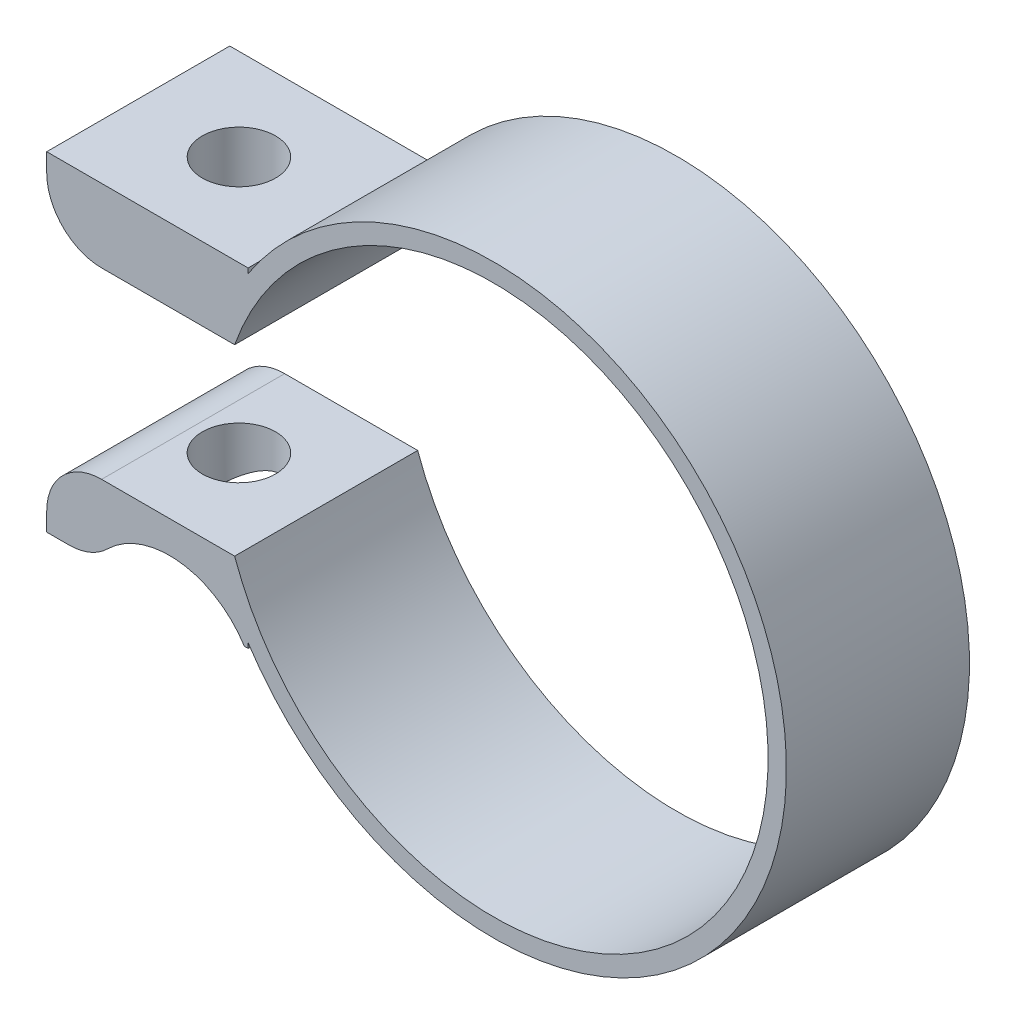
ISO-10303-21;
HEADER;
FILE_DESCRIPTION(('STEP AP214'),'2;1');
FILE_NAME('part.step','',(''),(''),'','','');
FILE_SCHEMA(('AUTOMOTIVE_DESIGN { 1 0 10303 214 1 1 1 1 }'));
ENDSEC;
DATA;
#1=APPLICATION_CONTEXT('core data for automotive mechanical design processes');
#2=APPLICATION_PROTOCOL_DEFINITION('international standard','automotive_design',2000,#1);
#3=PRODUCT_CONTEXT('',#1,'mechanical');
#4=PRODUCT('Part','Part','',(#3));
#5=PRODUCT_RELATED_PRODUCT_CATEGORY('part','',(#4));
#6=PRODUCT_DEFINITION_FORMATION('','',#4);
#7=PRODUCT_DEFINITION_CONTEXT('part definition',#1,'design');
#8=PRODUCT_DEFINITION('design','',#6,#7);
#9=PRODUCT_DEFINITION_SHAPE('','',#8);
#10=(LENGTH_UNIT() NAMED_UNIT(*) SI_UNIT(.MILLI.,.METRE.));
#11=(NAMED_UNIT(*) PLANE_ANGLE_UNIT() SI_UNIT($,.RADIAN.));
#12=(NAMED_UNIT(*) SI_UNIT($,.STERADIAN.) SOLID_ANGLE_UNIT());
#13=UNCERTAINTY_MEASURE_WITH_UNIT(LENGTH_MEASURE(1.E-05),#10,'distance_accuracy_value','');
#14=(GEOMETRIC_REPRESENTATION_CONTEXT(3) GLOBAL_UNCERTAINTY_ASSIGNED_CONTEXT((#13)) GLOBAL_UNIT_ASSIGNED_CONTEXT((#10,
#11,#12)) REPRESENTATION_CONTEXT('',''));
#15=CARTESIAN_POINT('',(0.,0.,0.));
#16=DIRECTION('',(0.,0.,1.));
#17=DIRECTION('',(1.,0.,0.));
#18=AXIS2_PLACEMENT_3D('',#15,#16,#17);
#19=CARTESIAN_POINT('',(0.,-9.00000000000001,10.));
#20=DIRECTION('',(0.,-1.,0.));
#21=DIRECTION('',(1.,0.,0.));
#22=AXIS2_PLACEMENT_3D('',#19,#20,#21);
#23=PLANE('',#22);
#24=DIRECTION('',(-1.,0.,0.));
#25=VECTOR('',#24,1.);
#26=CARTESIAN_POINT('',(0.,-9.00000000000001,0.));
#27=LINE('',#26,#25);
#28=CARTESIAN_POINT('',(-23.1984559063869,-9.00000000000001,0.));
#29=VERTEX_POINT('',#28);
#30=CARTESIAN_POINT('',(-24.407545237898,-9.00000000000001,0.));
#31=VERTEX_POINT('',#30);
#32=EDGE_CURVE('E167',#29,#31,#27,.T.);
#33=ORIENTED_EDGE('',*,*,#32,.F.);
#34=DIRECTION('',(0.,0.,1.));
#35=VECTOR('',#34,1.);
#36=CARTESIAN_POINT('',(-23.1984559063869,-9.00000000000001,10.));
#37=LINE('',#36,#35);
#38=CARTESIAN_POINT('',(-23.1984559063869,-9.00000000000001,10.));
#39=VERTEX_POINT('',#38);
#40=EDGE_CURVE('E45',#29,#39,#37,.T.);
#41=ORIENTED_EDGE('',*,*,#40,.T.);
#42=DIRECTION('',(-1.,0.,0.));
#43=VECTOR('',#42,1.);
#44=CARTESIAN_POINT('',(0.,-9.00000000000001,10.));
#45=LINE('',#44,#43);
#46=CARTESIAN_POINT('',(-24.407545237898,-9.00000000000001,10.));
#47=VERTEX_POINT('',#46);
#48=EDGE_CURVE('E312',#39,#47,#45,.T.);
#49=ORIENTED_EDGE('',*,*,#48,.T.);
#50=DIRECTION('',(0.,0.,-1.));
#51=VECTOR('',#50,1.);
#52=CARTESIAN_POINT('',(-24.407545237898,-9.00000000000001,10.));
#53=LINE('',#52,#51);
#54=EDGE_CURVE('E199',#47,#31,#53,.T.);
#55=ORIENTED_EDGE('',*,*,#54,.T.);
#56=EDGE_LOOP('',(#33,#41,#49,#55));
#57=FACE_BOUND('',#56,.T.);
#58=ADVANCED_FACE('F37',(#57),#23,.T.);
#59=CARTESIAN_POINT('',(0.,4.99999999999999,10.));
#60=DIRECTION('',(0.,-1.,0.));
#61=DIRECTION('',(0.,0.,-1.));
#62=AXIS2_PLACEMENT_3D('',#59,#60,#61);
#63=PLANE('',#62);
#64=CARTESIAN_POINT('',(-18.907545237898,4.99999999999999,5.));
#65=DIRECTION('',(0.,-1.,0.));
#66=DIRECTION('',(0.,0.,-1.));
#67=AXIS2_PLACEMENT_3D('',#64,#65,#66);
#68=CIRCLE('',#67,2.);
#69=CARTESIAN_POINT('',(-18.907545237898,4.99999999999999,3.));
#70=VERTEX_POINT('',#69);
#71=EDGE_CURVE('E306',#70,#70,#68,.T.);
#72=ORIENTED_EDGE('',*,*,#71,.F.);
#73=EDGE_LOOP('',(#72));
#74=FACE_BOUND('',#73,.T.);
#75=DIRECTION('',(-1.,0.,0.));
#76=VECTOR('',#75,1.);
#77=CARTESIAN_POINT('',(0.,4.99999999999999,10.));
#78=LINE('',#77,#76);
#79=CARTESIAN_POINT('',(-14.1421356237309,5.00000000000001,10.));
#80=VERTEX_POINT('',#79);
#81=CARTESIAN_POINT('',(-21.407545237898,4.99999999999999,10.));
#82=VERTEX_POINT('',#81);
#83=EDGE_CURVE('E185',#80,#82,#78,.T.);
#84=ORIENTED_EDGE('',*,*,#83,.T.);
#85=DIRECTION('',(0.,0.,-1.));
#86=VECTOR('',#85,1.);
#87=CARTESIAN_POINT('',(-21.407545237898,4.99999999999999,0.));
#88=LINE('',#87,#86);
#89=CARTESIAN_POINT('',(-21.407545237898,4.99999999999999,0.));
#90=VERTEX_POINT('',#89);
#91=EDGE_CURVE('E220',#82,#90,#88,.T.);
#92=ORIENTED_EDGE('',*,*,#91,.T.);
#93=DIRECTION('',(-1.,0.,0.));
#94=VECTOR('',#93,1.);
#95=CARTESIAN_POINT('',(0.,4.99999999999999,0.));
#96=LINE('',#95,#94);
#97=CARTESIAN_POINT('',(-14.1421356237309,5.00000000000001,0.));
#98=VERTEX_POINT('',#97);
#99=EDGE_CURVE('E324',#98,#90,#96,.T.);
#100=ORIENTED_EDGE('',*,*,#99,.F.);
#101=DIRECTION('',(0.,0.,-1.));
#102=VECTOR('',#101,1.);
#103=CARTESIAN_POINT('',(-14.1421356237309,5.00000000000001,10.));
#104=LINE('',#103,#102);
#105=EDGE_CURVE('E205',#80,#98,#104,.T.);
#106=ORIENTED_EDGE('',*,*,#105,.F.);
#107=EDGE_LOOP('',(#84,#92,#100,#106));
#108=FACE_BOUND('',#107,.T.);
#109=ADVANCED_FACE('F246',(#74,#108),#63,.T.);
#110=CARTESIAN_POINT('',(0.,0.,10.));
#111=DIRECTION('',(0.,0.,-1.));
#112=DIRECTION('',(-1.,0.,0.));
#113=AXIS2_PLACEMENT_3D('',#110,#111,#112);
#114=CYLINDRICAL_SURFACE('',#113,15.);
#115=CARTESIAN_POINT('',(0.,0.,0.));
#116=DIRECTION('',(0.,0.,1.));
#117=DIRECTION('',(1.,0.,0.));
#118=AXIS2_PLACEMENT_3D('',#115,#116,#117);
#119=CIRCLE('',#118,15.);
#120=CARTESIAN_POINT('',(-14.1421356237309,-5.00000000000001,0.));
#121=VERTEX_POINT('',#120);
#122=EDGE_CURVE('E326',#121,#98,#119,.T.);
#123=ORIENTED_EDGE('',*,*,#122,.F.);
#124=DIRECTION('',(0.,0.,-1.));
#125=VECTOR('',#124,1.);
#126=CARTESIAN_POINT('',(-14.1421356237309,-5.00000000000001,10.));
#127=LINE('',#126,#125);
#128=CARTESIAN_POINT('',(-14.1421356237309,-5.00000000000001,10.));
#129=VERTEX_POINT('',#128);
#130=EDGE_CURVE('E202',#129,#121,#127,.T.);
#131=ORIENTED_EDGE('',*,*,#130,.F.);
#132=CARTESIAN_POINT('',(0.,0.,10.));
#133=DIRECTION('',(0.,0.,1.));
#134=DIRECTION('',(1.,0.,0.));
#135=AXIS2_PLACEMENT_3D('',#132,#133,#134);
#136=CIRCLE('',#135,15.);
#137=EDGE_CURVE('E301',#129,#80,#136,.T.);
#138=ORIENTED_EDGE('',*,*,#137,.T.);
#139=ORIENTED_EDGE('',*,*,#105,.T.);
#140=EDGE_LOOP('',(#123,#131,#138,#139));
#141=FACE_BOUND('',#140,.T.);
#142=ADVANCED_FACE('F251',(#141),#114,.F.);
#143=CARTESIAN_POINT('',(0.,-5.00000000000001,10.));
#144=DIRECTION('',(0.,1.,0.));
#145=DIRECTION('',(0.,0.,1.));
#146=AXIS2_PLACEMENT_3D('',#143,#144,#145);
#147=PLANE('',#146);
#148=CARTESIAN_POINT('',(-18.907545237898,-5.00000000000001,5.));
#149=DIRECTION('',(0.,1.,0.));
#150=DIRECTION('',(0.,0.,1.));
#151=AXIS2_PLACEMENT_3D('',#148,#149,#150);
#152=CIRCLE('',#151,2.);
#153=CARTESIAN_POINT('',(-18.907545237898,-5.00000000000001,7.));
#154=VERTEX_POINT('',#153);
#155=EDGE_CURVE('E362',#154,#154,#152,.T.);
#156=ORIENTED_EDGE('',*,*,#155,.F.);
#157=EDGE_LOOP('',(#156));
#158=FACE_BOUND('',#157,.T.);
#159=DIRECTION('',(1.,0.,0.));
#160=VECTOR('',#159,1.);
#161=CARTESIAN_POINT('',(0.,-5.00000000000001,0.));
#162=LINE('',#161,#160);
#163=CARTESIAN_POINT('',(-21.407545237898,-5.00000000000001,0.));
#164=VERTEX_POINT('',#163);
#165=EDGE_CURVE('E328',#164,#121,#162,.T.);
#166=ORIENTED_EDGE('',*,*,#165,.F.);
#167=DIRECTION('',(0.,0.,-1.));
#168=VECTOR('',#167,1.);
#169=CARTESIAN_POINT('',(-21.407545237898,-5.00000000000001,10.));
#170=LINE('',#169,#168);
#171=CARTESIAN_POINT('',(-21.407545237898,-5.00000000000001,10.));
#172=VERTEX_POINT('',#171);
#173=EDGE_CURVE('E214',#164,#172,#170,.F.);
#174=ORIENTED_EDGE('',*,*,#173,.T.);
#175=DIRECTION('',(1.,0.,0.));
#176=VECTOR('',#175,1.);
#177=CARTESIAN_POINT('',(0.,-5.00000000000001,10.));
#178=LINE('',#177,#176);
#179=EDGE_CURVE('E303',#172,#129,#178,.T.);
#180=ORIENTED_EDGE('',*,*,#179,.T.);
#181=ORIENTED_EDGE('',*,*,#130,.T.);
#182=EDGE_LOOP('',(#166,#174,#180,#181));
#183=FACE_BOUND('',#182,.T.);
#184=ADVANCED_FACE('F265',(#158,#183),#147,.T.);
#185=CARTESIAN_POINT('',(-24.407545237898,0.,10.));
#186=DIRECTION('',(-1.,0.,0.));
#187=DIRECTION('',(0.,0.,1.));
#188=AXIS2_PLACEMENT_3D('',#185,#186,#187);
#189=PLANE('',#188);
#190=DIRECTION('',(0.,1.,0.));
#191=VECTOR('',#190,1.);
#192=CARTESIAN_POINT('',(-24.407545237898,0.,10.));
#193=LINE('',#192,#191);
#194=CARTESIAN_POINT('',(-24.407545237898,-8.00000000000001,10.));
#195=VERTEX_POINT('',#194);
#196=EDGE_CURVE('E310',#47,#195,#193,.T.);
#197=ORIENTED_EDGE('',*,*,#196,.T.);
#198=DIRECTION('',(0.,0.,-1.));
#199=VECTOR('',#198,1.);
#200=CARTESIAN_POINT('',(-24.407545237898,-8.00000000000001,10.));
#201=LINE('',#200,#199);
#202=CARTESIAN_POINT('',(-24.407545237898,-8.00000000000001,0.));
#203=VERTEX_POINT('',#202);
#204=EDGE_CURVE('E207',#195,#203,#201,.T.);
#205=ORIENTED_EDGE('',*,*,#204,.T.);
#206=DIRECTION('',(0.,1.,0.));
#207=VECTOR('',#206,1.);
#208=CARTESIAN_POINT('',(-24.407545237898,0.,0.));
#209=LINE('',#208,#207);
#210=EDGE_CURVE('E171',#31,#203,#209,.T.);
#211=ORIENTED_EDGE('',*,*,#210,.F.);
#212=ORIENTED_EDGE('',*,*,#54,.F.);
#213=EDGE_LOOP('',(#197,#205,#211,#212));
#214=FACE_BOUND('',#213,.T.);
#215=ADVANCED_FACE('F258',(#214),#189,.T.);
#216=DIRECTION('',(0.,0.,-1.));
#217=VECTOR('',#216,1.);
#218=CARTESIAN_POINT('',(-13.609888338559,-9.00000000000001,21.));
#219=LINE('',#218,#217);
#220=CARTESIAN_POINT('',(-13.609888338559,-9.00000000000001,0.));
#221=VERTEX_POINT('',#220);
#222=CARTESIAN_POINT('',(-13.609888338559,-9.00000000000001,10.));
#223=VERTEX_POINT('',#222);
#224=EDGE_CURVE('E146',#221,#223,#219,.F.);
#225=ORIENTED_EDGE('',*,*,#224,.F.);
#226=CARTESIAN_POINT('',(-13.407545237898,-9.00000000000001,0.));
#227=VERTEX_POINT('',#226);
#228=EDGE_CURVE('E157',#227,#221,#27,.T.);
#229=ORIENTED_EDGE('',*,*,#228,.F.);
#230=DIRECTION('',(0.,0.,-1.));
#231=VECTOR('',#230,1.);
#232=CARTESIAN_POINT('',(-13.407545237898,-9.00000000000001,10.));
#233=LINE('',#232,#231);
#234=CARTESIAN_POINT('',(-13.407545237898,-9.00000000000001,10.));
#235=VERTEX_POINT('',#234);
#236=EDGE_CURVE('E197',#235,#227,#233,.T.);
#237=ORIENTED_EDGE('',*,*,#236,.F.);
#238=EDGE_CURVE('E159',#235,#223,#45,.T.);
#239=ORIENTED_EDGE('',*,*,#238,.T.);
#240=EDGE_LOOP('',(#225,#229,#237,#239));
#241=FACE_BOUND('',#240,.T.);
#242=ADVANCED_FACE('F156',(#241),#23,.T.);
#243=CARTESIAN_POINT('',(-13.407545237898,0.,10.));
#244=DIRECTION('',(-1.,0.,0.));
#245=DIRECTION('',(0.,0.,1.));
#246=AXIS2_PLACEMENT_3D('',#243,#244,#245);
#247=PLANE('',#246);
#248=DIRECTION('',(0.,1.,0.));
#249=VECTOR('',#248,1.);
#250=CARTESIAN_POINT('',(-13.407545237898,0.,0.));
#251=LINE('',#250,#249);
#252=CARTESIAN_POINT('',(-13.407545237898,-8.73142203158911,0.));
#253=VERTEX_POINT('',#252);
#254=EDGE_CURVE('E166',#227,#253,#251,.T.);
#255=ORIENTED_EDGE('',*,*,#254,.T.);
#256=DIRECTION('',(0.,0.,-1.));
#257=VECTOR('',#256,1.);
#258=CARTESIAN_POINT('',(-13.407545237898,-8.73142203158911,10.));
#259=LINE('',#258,#257);
#260=CARTESIAN_POINT('',(-13.407545237898,-8.73142203158911,10.));
#261=VERTEX_POINT('',#260);
#262=EDGE_CURVE('E194',#261,#253,#259,.T.);
#263=ORIENTED_EDGE('',*,*,#262,.F.);
#264=DIRECTION('',(0.,1.,0.));
#265=VECTOR('',#264,1.);
#266=CARTESIAN_POINT('',(-13.407545237898,0.,10.));
#267=LINE('',#266,#265);
#268=EDGE_CURVE('E314',#235,#261,#267,.T.);
#269=ORIENTED_EDGE('',*,*,#268,.F.);
#270=ORIENTED_EDGE('',*,*,#236,.T.);
#271=EDGE_LOOP('',(#255,#263,#269,#270));
#272=FACE_BOUND('',#271,.T.);
#273=ADVANCED_FACE('F257',(#272),#247,.F.);
#274=CARTESIAN_POINT('',(0.,0.,10.));
#275=DIRECTION('',(0.,0.,-1.));
#276=DIRECTION('',(-1.,0.,0.));
#277=AXIS2_PLACEMENT_3D('',#274,#275,#276);
#278=CYLINDRICAL_SURFACE('',#277,16.);
#279=CARTESIAN_POINT('',(0.,0.,0.));
#280=DIRECTION('',(0.,0.,1.));
#281=DIRECTION('',(1.,0.,0.));
#282=AXIS2_PLACEMENT_3D('',#279,#280,#281);
#283=CIRCLE('',#282,16.);
#284=CARTESIAN_POINT('',(-13.407545237898,8.73142203158911,0.));
#285=VERTEX_POINT('',#284);
#286=EDGE_CURVE('E169',#253,#285,#283,.T.);
#287=ORIENTED_EDGE('',*,*,#286,.T.);
#288=DIRECTION('',(0.,0.,-1.));
#289=VECTOR('',#288,1.);
#290=CARTESIAN_POINT('',(-13.407545237898,8.73142203158911,10.));
#291=LINE('',#290,#289);
#292=CARTESIAN_POINT('',(-13.407545237898,8.73142203158911,10.));
#293=VERTEX_POINT('',#292);
#294=EDGE_CURVE('E192',#293,#285,#291,.T.);
#295=ORIENTED_EDGE('',*,*,#294,.F.);
#296=CARTESIAN_POINT('',(0.,0.,10.));
#297=DIRECTION('',(0.,0.,1.));
#298=DIRECTION('',(1.,0.,0.));
#299=AXIS2_PLACEMENT_3D('',#296,#297,#298);
#300=CIRCLE('',#299,16.);
#301=EDGE_CURVE('E316',#261,#293,#300,.T.);
#302=ORIENTED_EDGE('',*,*,#301,.F.);
#303=ORIENTED_EDGE('',*,*,#262,.T.);
#304=EDGE_LOOP('',(#287,#295,#302,#303));
#305=FACE_BOUND('',#304,.T.);
#306=ADVANCED_FACE('F263',(#305),#278,.T.);
#307=CARTESIAN_POINT('',(-13.407545237898,0.,10.));
#308=DIRECTION('',(1.,0.,0.));
#309=DIRECTION('',(0.,0.,-1.));
#310=AXIS2_PLACEMENT_3D('',#307,#308,#309);
#311=PLANE('',#310);
#312=DIRECTION('',(0.,-1.,0.));
#313=VECTOR('',#312,1.);
#314=CARTESIAN_POINT('',(-13.407545237898,0.,0.));
#315=LINE('',#314,#313);
#316=CARTESIAN_POINT('',(-13.407545237898,8.99999999999999,0.));
#317=VERTEX_POINT('',#316);
#318=EDGE_CURVE('E177',#317,#285,#315,.T.);
#319=ORIENTED_EDGE('',*,*,#318,.F.);
#320=DIRECTION('',(0.,0.,-1.));
#321=VECTOR('',#320,1.);
#322=CARTESIAN_POINT('',(-13.407545237898,8.99999999999999,10.));
#323=LINE('',#322,#321);
#324=CARTESIAN_POINT('',(-13.407545237898,8.99999999999999,10.));
#325=VERTEX_POINT('',#324);
#326=EDGE_CURVE('E189',#325,#317,#323,.T.);
#327=ORIENTED_EDGE('',*,*,#326,.F.);
#328=DIRECTION('',(0.,-1.,0.));
#329=VECTOR('',#328,1.);
#330=CARTESIAN_POINT('',(-13.407545237898,0.,10.));
#331=LINE('',#330,#329);
#332=EDGE_CURVE('E318',#325,#293,#331,.T.);
#333=ORIENTED_EDGE('',*,*,#332,.T.);
#334=ORIENTED_EDGE('',*,*,#294,.T.);
#335=EDGE_LOOP('',(#319,#327,#333,#334));
#336=FACE_BOUND('',#335,.T.);
#337=ADVANCED_FACE('F352',(#336),#311,.T.);
#338=CARTESIAN_POINT('',(0.,8.99999999999999,10.));
#339=DIRECTION('',(0.,-1.,0.));
#340=DIRECTION('',(1.,0.,0.));
#341=AXIS2_PLACEMENT_3D('',#338,#339,#340);
#342=PLANE('',#341);
#343=CARTESIAN_POINT('',(-18.907545237898,8.99999999999999,5.));
#344=DIRECTION('',(0.,1.,0.));
#345=DIRECTION('',(-1.,0.,0.));
#346=AXIS2_PLACEMENT_3D('',#343,#344,#345);
#347=CIRCLE('',#346,2.);
#348=CARTESIAN_POINT('',(-20.907545237898,8.99999999999999,5.));
#349=VERTEX_POINT('',#348);
#350=EDGE_CURVE('E160',#349,#349,#347,.T.);
#351=ORIENTED_EDGE('',*,*,#350,.F.);
#352=EDGE_LOOP('',(#351));
#353=FACE_BOUND('',#352,.T.);
#354=DIRECTION('',(-1.,0.,0.));
#355=VECTOR('',#354,1.);
#356=CARTESIAN_POINT('',(0.,8.99999999999999,0.));
#357=LINE('',#356,#355);
#358=CARTESIAN_POINT('',(-24.407545237898,8.99999999999999,0.));
#359=VERTEX_POINT('',#358);
#360=EDGE_CURVE('E180',#317,#359,#357,.T.);
#361=ORIENTED_EDGE('',*,*,#360,.T.);
#362=DIRECTION('',(0.,0.,-1.));
#363=VECTOR('',#362,1.);
#364=CARTESIAN_POINT('',(-24.407545237898,8.99999999999999,10.));
#365=LINE('',#364,#363);
#366=CARTESIAN_POINT('',(-24.407545237898,8.99999999999999,10.));
#367=VERTEX_POINT('',#366);
#368=EDGE_CURVE('E186',#367,#359,#365,.T.);
#369=ORIENTED_EDGE('',*,*,#368,.F.);
#370=DIRECTION('',(-1.,0.,0.));
#371=VECTOR('',#370,1.);
#372=CARTESIAN_POINT('',(0.,8.99999999999999,10.));
#373=LINE('',#372,#371);
#374=EDGE_CURVE('E321',#325,#367,#373,.T.);
#375=ORIENTED_EDGE('',*,*,#374,.F.);
#376=ORIENTED_EDGE('',*,*,#326,.T.);
#377=EDGE_LOOP('',(#361,#369,#375,#376));
#378=FACE_BOUND('',#377,.T.);
#379=ADVANCED_FACE('F348',(#353,#378),#342,.F.);
#380=CARTESIAN_POINT('',(-24.407545237898,0.,10.));
#381=DIRECTION('',(1.,0.,0.));
#382=DIRECTION('',(0.,0.,-1.));
#383=AXIS2_PLACEMENT_3D('',#380,#381,#382);
#384=PLANE('',#383);
#385=DIRECTION('',(0.,-1.,0.));
#386=VECTOR('',#385,1.);
#387=CARTESIAN_POINT('',(-24.407545237898,0.,0.));
#388=LINE('',#387,#386);
#389=CARTESIAN_POINT('',(-24.407545237898,7.99999999999999,0.));
#390=VERTEX_POINT('',#389);
#391=EDGE_CURVE('E182',#359,#390,#388,.T.);
#392=ORIENTED_EDGE('',*,*,#391,.T.);
#393=DIRECTION('',(0.,0.,-1.));
#394=VECTOR('',#393,1.);
#395=CARTESIAN_POINT('',(-24.407545237898,7.99999999999999,10.));
#396=LINE('',#395,#394);
#397=CARTESIAN_POINT('',(-24.407545237898,7.99999999999999,10.));
#398=VERTEX_POINT('',#397);
#399=EDGE_CURVE('E223',#390,#398,#396,.F.);
#400=ORIENTED_EDGE('',*,*,#399,.T.);
#401=DIRECTION('',(0.,-1.,0.));
#402=VECTOR('',#401,1.);
#403=CARTESIAN_POINT('',(-24.407545237898,0.,10.));
#404=LINE('',#403,#402);
#405=EDGE_CURVE('E190',#367,#398,#404,.T.);
#406=ORIENTED_EDGE('',*,*,#405,.F.);
#407=ORIENTED_EDGE('',*,*,#368,.T.);
#408=EDGE_LOOP('',(#392,#400,#406,#407));
#409=FACE_BOUND('',#408,.T.);
#410=ADVANCED_FACE('F344',(#409),#384,.F.);
#411=CARTESIAN_POINT('',(0.,0.,10.));
#412=DIRECTION('',(0.,0.,1.));
#413=DIRECTION('',(1.,0.,0.));
#414=AXIS2_PLACEMENT_3D('',#411,#412,#413);
#415=PLANE('',#414);
#416=ORIENTED_EDGE('',*,*,#48,.F.);
#417=CARTESIAN_POINT('',(-23.1984559063869,-6.00000000000001,10.));
#418=DIRECTION('',(0.,0.,1.));
#419=DIRECTION('',(1.,0.,0.));
#420=AXIS2_PLACEMENT_3D('',#417,#418,#419);
#421=CIRCLE('',#420,3.);
#422=CARTESIAN_POINT('',(-21.0930665391962,-8.1371325678395,10.));
#423=VERTEX_POINT('',#422);
#424=EDGE_CURVE('E11',#39,#423,#421,.T.);
#425=ORIENTED_EDGE('',*,*,#424,.T.);
#426=CARTESIAN_POINT('',(-17.6989929909035,-11.5823789582388,10.));
#427=DIRECTION('',(0.,0.,1.));
#428=DIRECTION('',(1.,0.,0.));
#429=AXIS2_PLACEMENT_3D('',#426,#427,#428);
#430=CIRCLE('',#429,4.83626487506417);
#431=EDGE_CURVE('E161',#223,#423,#430,.T.);
#432=ORIENTED_EDGE('',*,*,#431,.F.);
#433=ORIENTED_EDGE('',*,*,#238,.F.);
#434=ORIENTED_EDGE('',*,*,#268,.T.);
#435=ORIENTED_EDGE('',*,*,#301,.T.);
#436=ORIENTED_EDGE('',*,*,#332,.F.);
#437=ORIENTED_EDGE('',*,*,#374,.T.);
#438=ORIENTED_EDGE('',*,*,#405,.T.);
#439=CARTESIAN_POINT('',(-21.407545237898,7.99999999999999,10.));
#440=DIRECTION('',(0.,0.,1.));
#441=DIRECTION('',(1.,0.,0.));
#442=AXIS2_PLACEMENT_3D('',#439,#440,#441);
#443=CIRCLE('',#442,3.);
#444=EDGE_CURVE('E216',#398,#82,#443,.T.);
#445=ORIENTED_EDGE('',*,*,#444,.T.);
#446=ORIENTED_EDGE('',*,*,#83,.F.);
#447=ORIENTED_EDGE('',*,*,#137,.F.);
#448=ORIENTED_EDGE('',*,*,#179,.F.);
#449=CARTESIAN_POINT('',(-21.407545237898,-8.00000000000001,10.));
#450=DIRECTION('',(0.,0.,1.));
#451=DIRECTION('',(1.,0.,0.));
#452=AXIS2_PLACEMENT_3D('',#449,#450,#451);
#453=CIRCLE('',#452,3.);
#454=EDGE_CURVE('E218',#172,#195,#453,.T.);
#455=ORIENTED_EDGE('',*,*,#454,.T.);
#456=ORIENTED_EDGE('',*,*,#196,.F.);
#457=EDGE_LOOP('',(#416,#425,#432,#433,#434,#435,#436,#437,#438,#445,#446,#447,#448,#455,#456));
#458=FACE_BOUND('',#457,.T.);
#459=ADVANCED_FACE('F294',(#458),#415,.T.);
#460=CARTESIAN_POINT('',(0.,0.,0.));
#461=DIRECTION('',(0.,0.,1.));
#462=DIRECTION('',(1.,0.,0.));
#463=AXIS2_PLACEMENT_3D('',#460,#461,#462);
#464=PLANE('',#463);
#465=CARTESIAN_POINT('',(-17.6989929909035,-11.5823789582388,0.));
#466=DIRECTION('',(0.,0.,-1.));
#467=DIRECTION('',(-1.,0.,0.));
#468=AXIS2_PLACEMENT_3D('',#465,#466,#467);
#469=CIRCLE('',#468,4.83626487506417);
#470=CARTESIAN_POINT('',(-21.0930665391962,-8.1371325678395,0.));
#471=VERTEX_POINT('',#470);
#472=EDGE_CURVE('E141',#471,#221,#469,.T.);
#473=ORIENTED_EDGE('',*,*,#472,.F.);
#474=CARTESIAN_POINT('',(-23.1984559063869,-6.00000000000001,0.));
#475=DIRECTION('',(0.,0.,1.));
#476=DIRECTION('',(1.,0.,0.));
#477=AXIS2_PLACEMENT_3D('',#474,#475,#476);
#478=CIRCLE('',#477,3.);
#479=EDGE_CURVE('E59',#471,#29,#478,.F.);
#480=ORIENTED_EDGE('',*,*,#479,.T.);
#481=ORIENTED_EDGE('',*,*,#32,.T.);
#482=ORIENTED_EDGE('',*,*,#210,.T.);
#483=CARTESIAN_POINT('',(-21.407545237898,-8.00000000000001,0.));
#484=DIRECTION('',(0.,0.,1.));
#485=DIRECTION('',(1.,0.,0.));
#486=AXIS2_PLACEMENT_3D('',#483,#484,#485);
#487=CIRCLE('',#486,3.);
#488=EDGE_CURVE('E212',#203,#164,#487,.F.);
#489=ORIENTED_EDGE('',*,*,#488,.T.);
#490=ORIENTED_EDGE('',*,*,#165,.T.);
#491=ORIENTED_EDGE('',*,*,#122,.T.);
#492=ORIENTED_EDGE('',*,*,#99,.T.);
#493=CARTESIAN_POINT('',(-21.407545237898,7.99999999999999,0.));
#494=DIRECTION('',(0.,0.,1.));
#495=DIRECTION('',(1.,0.,0.));
#496=AXIS2_PLACEMENT_3D('',#493,#494,#495);
#497=CIRCLE('',#496,3.);
#498=EDGE_CURVE('E210',#90,#390,#497,.F.);
#499=ORIENTED_EDGE('',*,*,#498,.T.);
#500=ORIENTED_EDGE('',*,*,#391,.F.);
#501=ORIENTED_EDGE('',*,*,#360,.F.);
#502=ORIENTED_EDGE('',*,*,#318,.T.);
#503=ORIENTED_EDGE('',*,*,#286,.F.);
#504=ORIENTED_EDGE('',*,*,#254,.F.);
#505=ORIENTED_EDGE('',*,*,#228,.T.);
#506=EDGE_LOOP('',(#473,#480,#481,#482,#489,#490,#491,#492,#499,#500,#501,#502,#503,#504,#505));
#507=FACE_BOUND('',#506,.T.);
#508=ADVANCED_FACE('F164',(#507),#464,.F.);
#509=CARTESIAN_POINT('',(-21.407545237898,-8.00000000000001,10.));
#510=DIRECTION('',(0.,0.,-1.));
#511=DIRECTION('',(-1.,0.,0.));
#512=AXIS2_PLACEMENT_3D('',#509,#510,#511);
#513=CYLINDRICAL_SURFACE('',#512,3.);
#514=ORIENTED_EDGE('',*,*,#454,.F.);
#515=ORIENTED_EDGE('',*,*,#173,.F.);
#516=ORIENTED_EDGE('',*,*,#488,.F.);
#517=ORIENTED_EDGE('',*,*,#204,.F.);
#518=EDGE_LOOP('',(#514,#515,#516,#517));
#519=FACE_BOUND('',#518,.T.);
#520=ADVANCED_FACE('F277',(#519),#513,.T.);
#521=CARTESIAN_POINT('',(-21.407545237898,7.99999999999999,10.));
#522=DIRECTION('',(0.,0.,1.));
#523=DIRECTION('',(1.,0.,0.));
#524=AXIS2_PLACEMENT_3D('',#521,#522,#523);
#525=CYLINDRICAL_SURFACE('',#524,3.);
#526=ORIENTED_EDGE('',*,*,#444,.F.);
#527=ORIENTED_EDGE('',*,*,#399,.F.);
#528=ORIENTED_EDGE('',*,*,#498,.F.);
#529=ORIENTED_EDGE('',*,*,#91,.F.);
#530=EDGE_LOOP('',(#526,#527,#528,#529));
#531=FACE_BOUND('',#530,.T.);
#532=ADVANCED_FACE('F279',(#531),#525,.T.);
#533=CARTESIAN_POINT('',(-18.907545237898,-12.,5.));
#534=DIRECTION('',(0.,1.,0.));
#535=DIRECTION('',(-1.,0.,0.));
#536=AXIS2_PLACEMENT_3D('',#533,#534,#535);
#537=CYLINDRICAL_SURFACE('',#536,2.);
#538=ORIENTED_EDGE('',*,*,#71,.T.);
#539=EDGE_LOOP('',(#538));
#540=FACE_BOUND('',#539,.T.);
#541=ORIENTED_EDGE('',*,*,#350,.T.);
#542=EDGE_LOOP('',(#541));
#543=FACE_BOUND('',#542,.T.);
#544=ADVANCED_FACE('F243',(#540,#543),#537,.F.);
#545=CARTESIAN_POINT('',(-20.907545237898,-7.96372583586213,5.));
#546=CARTESIAN_POINT('',(-20.9075363418491,-7.96371333335999,4.90423567697506));
#547=CARTESIAN_POINT('',(-20.9006012286889,-7.95753195739113,4.80832984340011));
#548=CARTESIAN_POINT('',(-20.8733998820642,-7.93369430594759,4.61980755821497));
#549=CARTESIAN_POINT('',(-20.8531001747951,-7.9160092188893,4.52719998316228));
#550=CARTESIAN_POINT('',(-20.8007752217177,-7.87164359220015,4.3486421673745));
#551=CARTESIAN_POINT('',(-20.7688524939642,-7.84504185781582,4.26264144857936));
#552=CARTESIAN_POINT('',(-20.6947336410331,-7.78537291886172,4.09770022540285));
#553=CARTESIAN_POINT('',(-20.6525369747287,-7.75230537375672,4.0187600932011));
#554=CARTESIAN_POINT('',(-20.5528991731829,-7.67737583526914,3.8585781553474));
#555=CARTESIAN_POINT('',(-20.4941808999361,-7.63492914202152,3.77840844622553));
#556=CARTESIAN_POINT('',(-20.3664072057234,-7.54748514456439,3.62834181632331));
#557=CARTESIAN_POINT('',(-20.2973442581796,-7.50248599817601,3.55845244931101));
#558=CARTESIAN_POINT('',(-20.1340808928099,-7.40257130976848,3.41578689988539));
#559=CARTESIAN_POINT('',(-20.037660731725,-7.34758777116294,3.34557427155215));
#560=CARTESIAN_POINT('',(-19.8325830318587,-7.24064741610308,3.22275777204176));
#561=CARTESIAN_POINT('',(-19.723920022239,-7.1886919686417,3.17016181508934));
#562=CARTESIAN_POINT('',(-19.4943716903515,-7.08994755928433,3.08403646389202));
#563=CARTESIAN_POINT('',(-19.3733015920675,-7.04326841177846,3.05086726146091));
#564=CARTESIAN_POINT('',(-19.124085457435,-6.95898193649236,3.00775334862421));
#565=CARTESIAN_POINT('',(-18.995948034032,-6.92136385363709,2.99778098162943));
#566=CARTESIAN_POINT('',(-18.7531858756621,-6.86095367867585,3.00273236221603));
#567=CARTESIAN_POINT('',(-18.6388111638694,-6.83691548588903,3.01477816833218));
#568=CARTESIAN_POINT('',(-18.4124263142959,-6.79764876590836,3.05883308058253));
#569=CARTESIAN_POINT('',(-18.3004149784835,-6.7824156666136,3.09083180805847));
#570=CARTESIAN_POINT('',(-18.0928994776866,-6.76115499675271,3.17036340864342));
#571=CARTESIAN_POINT('',(-17.9968199994493,-6.75441708052177,3.2162217144619));
#572=CARTESIAN_POINT('',(-17.8129993232151,-6.74658250538309,3.32272532402451));
#573=CARTESIAN_POINT('',(-17.7252581721053,-6.7454858781951,3.3833707109112));
#574=CARTESIAN_POINT('',(-17.5600825304585,-6.74739821670254,3.51818346372385));
#575=CARTESIAN_POINT('',(-17.4827116178032,-6.75043133981152,3.59242817558929));
#576=CARTESIAN_POINT('',(-17.3408577217106,-6.75886815688989,3.75223732697254));
#577=CARTESIAN_POINT('',(-17.2763775444341,-6.76427236620055,3.83780422447385));
#578=CARTESIAN_POINT('',(-17.1595024839197,-6.77592370590032,4.02187887539166));
#579=CARTESIAN_POINT('',(-17.1077257911621,-6.78219663605775,4.12077817079639));
#580=CARTESIAN_POINT('',(-17.0213005948888,-6.7936315526808,4.32586046546216));
#581=CARTESIAN_POINT('',(-16.9866524955561,-6.79879351292927,4.43204363653329));
#582=CARTESIAN_POINT('',(-16.9352150923172,-6.80673292181881,4.64990583168102));
#583=CARTESIAN_POINT('',(-16.9186129434087,-6.80948532491028,4.7616301149143));
#584=CARTESIAN_POINT('',(-16.90442740057,-6.81182572973969,4.98630690636331));
#585=CARTESIAN_POINT('',(-16.9068424781211,-6.81141398579752,5.09925931513913));
#586=CARTESIAN_POINT('',(-16.9304557684597,-6.80755502954772,5.32165753827038));
#587=CARTESIAN_POINT('',(-16.9514132778899,-6.80414671987125,5.4311297271067));
#588=CARTESIAN_POINT('',(-17.011155083904,-6.79518344652009,5.64500844326465));
#589=CARTESIAN_POINT('',(-17.049941375594,-6.78962824261115,5.74941440221061));
#590=CARTESIAN_POINT('',(-17.1445846068541,-6.77775942174109,5.95103064830235));
#591=CARTESIAN_POINT('',(-17.2005596272799,-6.77144074804765,6.04818519472865));
#592=CARTESIAN_POINT('',(-17.3279784505041,-6.75994329888143,6.23185281703747));
#593=CARTESIAN_POINT('',(-17.3994234194269,-6.75476460940002,6.3183650899343));
#594=CARTESIAN_POINT('',(-17.5563030006534,-6.74757961842978,6.47878302342091));
#595=CARTESIAN_POINT('',(-17.6418155315367,-6.74559169019407,6.55261350063267));
#596=CARTESIAN_POINT('',(-17.8240139516816,-6.74687440613918,6.68481955583015));
#597=CARTESIAN_POINT('',(-17.9206961551225,-6.75014332021681,6.74320021121314));
#598=CARTESIAN_POINT('',(-18.1186886029699,-6.76337365486844,6.84105475922737));
#599=CARTESIAN_POINT('',(-18.2197299991274,-6.77310391790804,6.88110363394383));
#600=CARTESIAN_POINT('',(-18.4260392698191,-6.79994567058148,6.94416601905091));
#601=CARTESIAN_POINT('',(-18.53130616798,-6.81705546385368,6.96718344122838));
#602=CARTESIAN_POINT('',(-18.7395169237471,-6.85821760513038,6.99561639274092));
#603=CARTESIAN_POINT('',(-18.8424371480762,-6.88204912787333,7.00153345432235));
#604=CARTESIAN_POINT('',(-19.0462034329965,-6.93634738759981,6.99779028688374));
#605=CARTESIAN_POINT('',(-19.1470490345809,-6.96681557601689,6.98812664741236));
#606=CARTESIAN_POINT('',(-19.348720457574,-7.03488657348699,6.95353499551393));
#607=CARTESIAN_POINT('',(-19.4493437272041,-7.0727475043801,6.92794370512081));
#608=CARTESIAN_POINT('',(-19.6437815240982,-7.15311911859705,6.86238967344806));
#609=CARTESIAN_POINT('',(-19.7375941602641,-7.19563108521425,6.82242295877063));
#610=CARTESIAN_POINT('',(-19.9274696680687,-7.28868841882966,6.72408760537306));
#611=CARTESIAN_POINT('',(-20.0225284888532,-7.33959336216238,6.66412085751114));
#612=CARTESIAN_POINT('',(-20.2011405202364,-7.44240753974241,6.52942724726378));
#613=CARTESIAN_POINT('',(-20.284676135924,-7.49431817473937,6.45467822802978));
#614=CARTESIAN_POINT('',(-20.4464940576627,-7.6010494785045,6.28331532219953));
#615=CARTESIAN_POINT('',(-20.5234148147694,-7.65564175102588,6.18526216783749));
#616=CARTESIAN_POINT('',(-20.6590436857798,-7.75684492125423,5.97363404757406));
#617=CARTESIAN_POINT('',(-20.7177886467583,-7.80347187958145,5.86009116614279));
#618=CARTESIAN_POINT('',(-20.7979630523229,-7.86921264084202,5.6587482685106));
#619=CARTESIAN_POINT('',(-20.8253145327509,-7.89234146820974,5.57460510470756));
#620=CARTESIAN_POINT('',(-20.8688053537153,-7.92962886319706,5.40167924621075));
#621=CARTESIAN_POINT('',(-20.8849789725171,-7.94381484327786,5.31291164151554));
#622=CARTESIAN_POINT('',(-20.8992139082784,-7.95635253170833,5.18612914857797));
#623=CARTESIAN_POINT('',(-20.9023320330891,-7.95910886687104,5.14903730216672));
#624=CARTESIAN_POINT('',(-20.9064997435732,-7.96279823056537,5.07463751245265));
#625=CARTESIAN_POINT('',(-20.9075487056312,-7.96373070941244,5.03732950739945));
#626=CARTESIAN_POINT('',(-20.907545237898,-7.96372583586213,5.));
#627=B_SPLINE_CURVE_WITH_KNOTS('',3,(#545,#546,#547,#548,#549,#550,#551,#552,#553,#554,#555,
#556,#557,#558,#559,#560,#561,#562,#563,#564,#565,#566,#567,#568,#569,#570,#571,#572,#573,#574,
#575,#576,#577,#578,#579,#580,#581,#582,#583,#584,#585,#586,#587,#588,#589,#590,#591,#592,#593,
#594,#595,#596,#597,#598,#599,#600,#601,#602,#603,#604,#605,#606,#607,#608,#609,#610,#611,#612,
#613,#614,#615,#616,#617,#618,#619,#620,#621,#622,#623,#624,#625,#626),.UNSPECIFIED.,.T.,.F.,(4,
2,2,2,2,2,2,2,2,2,2,2,2,2,2,2,2,2,2,2,2,2,2,2,2,2,2,2,2,2,2,2,2,2,2,2,2,2,2,2,4),(0.,
0.28712010274605,0.574962094520651,0.860324424507783,1.14570178773984,1.46875611350719,
1.79204663925395,2.18428978695513,2.57670891283458,2.97619069544561,3.37519594844469,
3.72571712517406,4.07605612766345,4.39458026393553,4.71310619119828,5.03350339676547,
5.35397027325411,5.68783931841044,6.02171624148929,6.35902371183627,6.69630407121162,
7.02926932634968,7.36227185059553,7.69761520232778,8.03298384104056,8.37027678186616,
8.70745873739993,9.03318462797265,9.35883568252664,9.67483376536833,9.99090102625291,
10.3211024048465,10.6513951220267,11.0200480606783,11.3892578120767,11.7954030258667,
12.2007193994464,12.4740526537866,12.7465439342477,12.8584313560174,12.9703524938842),.UNSPECIFIED.);
#628=CARTESIAN_POINT('',(-20.907545237898,-7.96372583586213,5.));
#629=VERTEX_POINT('',#628);
#630=EDGE_CURVE('E151',#629,#629,#627,.T.);
#631=ORIENTED_EDGE('',*,*,#630,.T.);
#632=EDGE_LOOP('',(#631));
#633=FACE_BOUND('',#632,.T.);
#634=ORIENTED_EDGE('',*,*,#155,.T.);
#635=EDGE_LOOP('',(#634));
#636=FACE_BOUND('',#635,.T.);
#637=ADVANCED_FACE('F233',(#633,#636),#537,.F.);
#638=CARTESIAN_POINT('',(-17.6989929909035,-11.5823789582388,21.));
#639=DIRECTION('',(0.,0.,-1.));
#640=DIRECTION('',(-1.,0.,0.));
#641=AXIS2_PLACEMENT_3D('',#638,#639,#640);
#642=CYLINDRICAL_SURFACE('',#641,4.83626487506417);
#643=ORIENTED_EDGE('',*,*,#431,.T.);
#644=DIRECTION('',(0.,0.,-1.));
#645=VECTOR('',#644,1.);
#646=CARTESIAN_POINT('',(-21.0930665391962,-8.1371325678395,21.));
#647=LINE('',#646,#645);
#648=EDGE_CURVE('E149',#423,#471,#647,.T.);
#649=ORIENTED_EDGE('',*,*,#648,.T.);
#650=ORIENTED_EDGE('',*,*,#472,.T.);
#651=ORIENTED_EDGE('',*,*,#224,.T.);
#652=EDGE_LOOP('',(#643,#649,#650,#651));
#653=FACE_BOUND('',#652,.T.);
#654=ORIENTED_EDGE('',*,*,#630,.F.);
#655=EDGE_LOOP('',(#654));
#656=FACE_BOUND('',#655,.T.);
#657=ADVANCED_FACE('F144',(#653,#656),#642,.F.);
#658=CARTESIAN_POINT('',(-23.1984559063869,-6.00000000000001,21.));
#659=DIRECTION('',(0.,0.,-1.));
#660=DIRECTION('',(-1.,0.,0.));
#661=AXIS2_PLACEMENT_3D('',#658,#659,#660);
#662=CYLINDRICAL_SURFACE('',#661,3.);
#663=ORIENTED_EDGE('',*,*,#424,.F.);
#664=ORIENTED_EDGE('',*,*,#40,.F.);
#665=ORIENTED_EDGE('',*,*,#479,.F.);
#666=ORIENTED_EDGE('',*,*,#648,.F.);
#667=EDGE_LOOP('',(#663,#664,#665,#666));
#668=FACE_BOUND('',#667,.T.);
#669=ADVANCED_FACE('F39',(#668),#662,.T.);
#670=CLOSED_SHELL('',(#58,#109,#142,#184,#215,#242,#273,#306,#337,#379,#410,#459,#508,#520,#532,
#544,#637,#657,#669));
#671=MANIFOLD_SOLID_BREP('B2',#670);
#672=ADVANCED_BREP_SHAPE_REPRESENTATION('',(#18,#671),#14);
#673=SHAPE_DEFINITION_REPRESENTATION(#9,#672);
ENDSEC;
END-ISO-10303-21;
